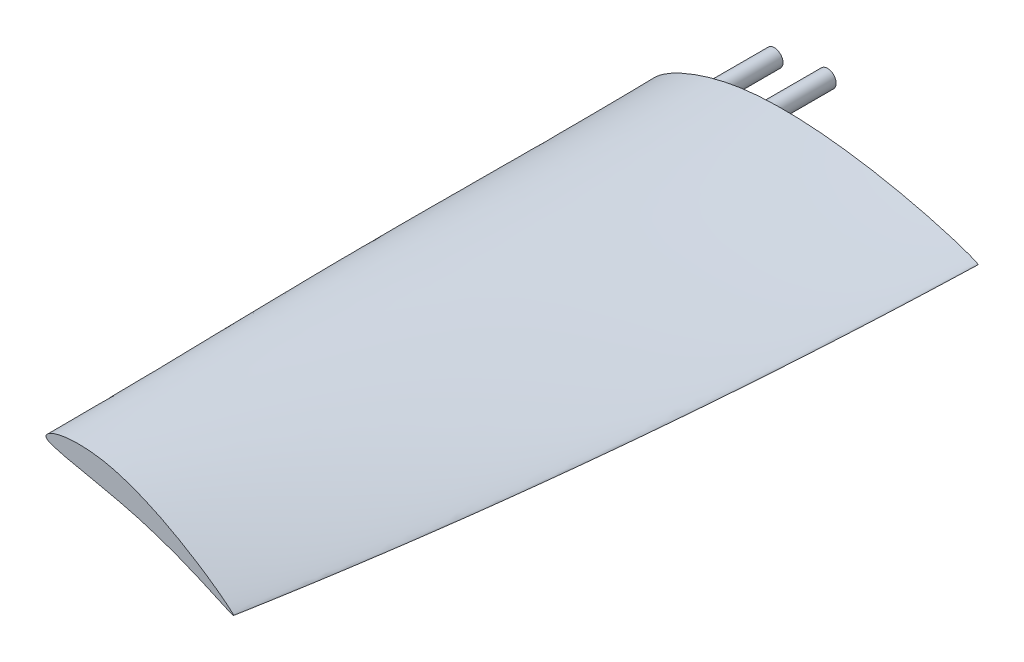
ISO-10303-21;
HEADER;
FILE_DESCRIPTION(('STEP AP214'),'2;1');
FILE_NAME('part.step','',(''),(''),'','','');
FILE_SCHEMA(('AUTOMOTIVE_DESIGN { 1 0 10303 214 1 1 1 1 }'));
ENDSEC;
DATA;
#1=APPLICATION_CONTEXT('core data for automotive mechanical design processes');
#2=APPLICATION_PROTOCOL_DEFINITION('international standard','automotive_design',2000,#1);
#3=PRODUCT_CONTEXT('',#1,'mechanical');
#4=PRODUCT('Part','Part','',(#3));
#5=PRODUCT_RELATED_PRODUCT_CATEGORY('part','',(#4));
#6=PRODUCT_DEFINITION_FORMATION('','',#4);
#7=PRODUCT_DEFINITION_CONTEXT('part definition',#1,'design');
#8=PRODUCT_DEFINITION('design','',#6,#7);
#9=PRODUCT_DEFINITION_SHAPE('','',#8);
#10=(LENGTH_UNIT() NAMED_UNIT(*) SI_UNIT(.MILLI.,.METRE.));
#11=(NAMED_UNIT(*) PLANE_ANGLE_UNIT() SI_UNIT($,.RADIAN.));
#12=(NAMED_UNIT(*) SI_UNIT($,.STERADIAN.) SOLID_ANGLE_UNIT());
#13=UNCERTAINTY_MEASURE_WITH_UNIT(LENGTH_MEASURE(1.E-05),#10,'distance_accuracy_value','');
#14=(GEOMETRIC_REPRESENTATION_CONTEXT(3) GLOBAL_UNCERTAINTY_ASSIGNED_CONTEXT((#13)) GLOBAL_UNIT_ASSIGNED_CONTEXT((#10,
#11,#12)) REPRESENTATION_CONTEXT('',''));
#15=CARTESIAN_POINT('',(0.,0.,0.));
#16=DIRECTION('',(0.,0.,1.));
#17=DIRECTION('',(1.,0.,0.));
#18=AXIS2_PLACEMENT_3D('',#15,#16,#17);
#19=CARTESIAN_POINT('',(0.,0.,0.));
#20=DIRECTION('',(0.,0.,1.));
#21=DIRECTION('',(1.,0.,0.));
#22=AXIS2_PLACEMENT_3D('',#19,#20,#21);
#23=PLANE('',#22);
#24=CARTESIAN_POINT('',(16.1545922957954,11.0402135577881,0.));
#25=DIRECTION('',(0.,0.,1.));
#26=DIRECTION('',(1.,0.,0.));
#27=AXIS2_PLACEMENT_3D('',#24,#25,#26);
#28=CIRCLE('',#27,2.5);
#29=CARTESIAN_POINT('',(18.6545922957954,11.0402135577881,0.));
#30=VERTEX_POINT('',#29);
#31=EDGE_CURVE('E63',#30,#30,#28,.F.);
#32=ORIENTED_EDGE('',*,*,#31,.F.);
#33=EDGE_LOOP('',(#32));
#34=FACE_BOUND('',#33,.T.);
#35=CARTESIAN_POINT('',(95.1052697015641,8.64289539133773,0.));
#36=CARTESIAN_POINT('',(95.1286443048925,8.54086350345673,0.));
#37=CARTESIAN_POINT('',(93.6373999787202,7.84881716845671,0.));
#38=CARTESIAN_POINT('',(52.3024701452342,13.7719575403638,0.));
#39=CARTESIAN_POINT('',(0.105539997127001,2.14606283403367,0.));
#40=CARTESIAN_POINT('',(-0.705893262256306,9.56382047975348,0.));
#41=CARTESIAN_POINT('',(32.647459862948,27.1253679543828,0.));
#42=CARTESIAN_POINT('',(87.100101196796,12.350906160891,0.));
#43=CARTESIAN_POINT('',(94.7973276750413,8.96260164870809,0.));
#44=CARTESIAN_POINT('',(95.0687945892292,8.71744855810595,0.));
#45=CARTESIAN_POINT('',(95.0983288438702,8.67319275313999,0.));
#46=CARTESIAN_POINT('',(95.1052697015641,8.64289539133773,0.));
#47=B_SPLINE_CURVE_WITH_KNOTS('',3,(#35,#36,#37,#38,#39,#40,#41,#42,#43,#44,#45,#46),
.UNSPECIFIED.,.T.,.F.,(4,1,1,1,1,1,1,1,1,4),(0.,0.0203697728095786,0.203697728058923,
0.356157624886157,0.395463832500693,0.596759804204282,0.959675980424115,0.991935196084823,
0.993951397063617,1.),.UNSPECIFIED.);
#48=CARTESIAN_POINT('',(95.1052697015641,8.64289539133773,0.));
#49=VERTEX_POINT('',#48);
#50=EDGE_CURVE('E71',#49,#49,#47,.T.);
#51=ORIENTED_EDGE('',*,*,#50,.T.);
#52=EDGE_LOOP('',(#51));
#53=FACE_BOUND('',#52,.T.);
#54=CARTESIAN_POINT('',(31.5512097241706,13.553947015482,0.));
#55=DIRECTION('',(0.,0.,1.));
#56=DIRECTION('',(1.,0.,0.));
#57=AXIS2_PLACEMENT_3D('',#54,#55,#56);
#58=CIRCLE('',#57,2.5);
#59=CARTESIAN_POINT('',(34.0512097241706,13.553947015482,0.));
#60=VERTEX_POINT('',#59);
#61=EDGE_CURVE('E12',#60,#60,#58,.F.);
#62=ORIENTED_EDGE('',*,*,#61,.F.);
#63=EDGE_LOOP('',(#62));
#64=FACE_BOUND('',#63,.T.);
#65=ADVANCED_FACE('F53',(#34,#53,#64),#23,.F.);
#66=CARTESIAN_POINT('',(36.0321446774879,8.08462591773713,180.));
#67=DIRECTION('',(0.,0.,-1.));
#68=DIRECTION('',(-1.,0.,0.));
#69=AXIS2_PLACEMENT_3D('',#66,#67,#68);
#70=PLANE('',#69);
#71=CARTESIAN_POINT('',(32.3516391595153,3.42891641202715,180.));
#72=CARTESIAN_POINT('',(46.0038360249802,-0.443143833158928,180.));
#73=CARTESIAN_POINT('',(61.1386685959756,-8.5429891593088,180.));
#74=CARTESIAN_POINT('',(57.1947597138644,-4.25442921391039,180.));
#75=CARTESIAN_POINT('',(28.2063763244082,16.1797835731895,180.));
#76=CARTESIAN_POINT('',(5.79739464769958,13.1228208000596,180.));
#77=CARTESIAN_POINT('',(4.73267983547473,8.77405761477878,180.));
#78=CARTESIAN_POINT('',(20.9981468743755,6.64901399445526,180.));
#79=CARTESIAN_POINT('',(32.3516391595153,3.42891641202715,180.));
#80=B_SPLINE_CURVE_WITH_KNOTS('',3,(#71,#72,#73,#74,#75,#76,#77,#78,#79),.UNSPECIFIED.,.T.,.F.,
(4,1,1,1,1,1,4),(0.,0.183327955249344,0.244021747634808,0.606937923854641,0.80823389555823,
0.847540103172766,1.),.UNSPECIFIED.);
#81=CARTESIAN_POINT('',(32.3516391595153,3.42891641202715,180.));
#82=VERTEX_POINT('',#81);
#83=EDGE_CURVE('E67',#82,#82,#80,.T.);
#84=ORIENTED_EDGE('',*,*,#83,.T.);
#85=EDGE_LOOP('',(#84));
#86=FACE_BOUND('',#85,.T.);
#87=ADVANCED_FACE('F85',(#86),#70,.F.);
#88=CARTESIAN_POINT('',(59.6282353848712,-7.05801971931992,180.));
#89=CARTESIAN_POINT('',(65.8250508196849,-6.3879164879489,149.944537816352));
#90=CARTESIAN_POINT('',(77.9467739051095,-3.10335834766765,89.8329940362058));
#91=CARTESIAN_POINT('',(89.4775036858622,4.07214017175802,29.9441246188426));
#92=CARTESIAN_POINT('',(95.1052697015641,8.64289539133773,0.));
#93=CARTESIAN_POINT('',(59.620476173678,-7.12034363770423,180.));
#94=CARTESIAN_POINT('',(65.8207044635046,-6.45759096964255,149.944537816352));
#95=CARTESIAN_POINT('',(77.94926594838,-3.18776128630056,89.8329940362058));
#96=CARTESIAN_POINT('',(89.4939088300595,3.97599186524667,29.9441246188426));
#97=CARTESIAN_POINT('',(95.1286443048925,8.54086350345673,0.));
#98=CARTESIAN_POINT('',(58.6376731282113,-7.20450877934647,180.));
#99=CARTESIAN_POINT('',(64.7361110750332,-6.61817361510636,149.944537816352));
#100=CARTESIAN_POINT('',(76.6607134045781,-3.50146306931555,89.8329940362058));
#101=CARTESIAN_POINT('',(88.0703119613591,3.41021629806378,29.9441246188426));
#102=CARTESIAN_POINT('',(93.6373999787202,7.84881716845671,0.));
#103=CARTESIAN_POINT('',(36.5478959924359,4.61747717587286,180.));
#104=CARTESIAN_POINT('',(39.4206723134616,4.98688855597323,149.944537816352));
#105=CARTESIAN_POINT('',(44.8819579750453,7.66894498352202,89.8329940362058));
#106=CARTESIAN_POINT('',(49.9247117298213,11.0846083148984,29.9441246188426));
#107=CARTESIAN_POINT('',(52.3024701452342,13.7719575403638,0.));
#108=CARTESIAN_POINT('',(4.73267983547473,8.77405761477878,180.));
#109=CARTESIAN_POINT('',(3.83974960466323,7.42267820557724,149.944537816352));
#110=CARTESIAN_POINT('',(1.7556207911214,6.65675493754226,89.8329940362058));
#111=CARTESIAN_POINT('',(0.755050593874905,3.00098910801779,29.9441246188426));
#112=CARTESIAN_POINT('',(0.105539997127001,2.14606283403367,0.));
#113=CARTESIAN_POINT('',(5.79739464769958,13.1228208000596,180.));
#114=CARTESIAN_POINT('',(4.723590049957,12.3201253450925,149.944537816352));
#115=CARTESIAN_POINT('',(2.27703998886601,12.6536100616042,89.8329940362058));
#116=CARTESIAN_POINT('',(0.388450760175923,9.94452702079389,29.9441246188426));
#117=CARTESIAN_POINT('',(-0.705893262256306,9.56382047975348,0.));
#118=CARTESIAN_POINT('',(28.2063763244082,16.1797835731895,180.));
#119=CARTESIAN_POINT('',(29.3756886292575,17.2440089512248,149.944537816352));
#120=CARTESIAN_POINT('',(31.4237125646344,21.3182767806366,89.8329940362058));
#121=CARTESIAN_POINT('',(32.3378434473303,24.5367811402193,29.9441246188426));
#122=CARTESIAN_POINT('',(32.647459862948,27.1253679543828,0.));
#123=CARTESIAN_POINT('',(55.8757253465376,-3.32462817694541,180.));
#124=CARTESIAN_POINT('',(61.4066099762098,-2.50259835488888,149.944537816352));
#125=CARTESIAN_POINT('',(72.1939954367084,1.08637784897081,89.8329940362058));
#126=CARTESIAN_POINT('',(82.2240600779467,7.94092460446027,29.9441246188426));
#127=CARTESIAN_POINT('',(87.100101196796,12.350906160891,0.));
#128=CARTESIAN_POINT('',(59.5202204628799,-6.81457092716951,180.));
#129=CARTESIAN_POINT('',(65.6885681966596,-6.12521409913936,149.944537816352));
#130=CARTESIAN_POINT('',(77.7532500335166,-2.80207717824146,89.8329940362058));
#131=CARTESIAN_POINT('',(89.2077481964506,4.38569714010175,29.9441246188426));
#132=CARTESIAN_POINT('',(94.7973276750413,8.96260164870809,0.));
#133=CARTESIAN_POINT('',(59.6229693593991,-7.00850034902975,180.));
#134=CARTESIAN_POINT('',(65.8158222376352,-6.33333843746423,149.944537816352));
#135=CARTESIAN_POINT('',(77.9296054766198,-3.03864412798359,89.8329940362058));
#136=CARTESIAN_POINT('',(89.447472091163,4.14340963483258,29.9441246188426));
#137=CARTESIAN_POINT('',(95.0687945892292,8.71744855810595,0.));
#138=CARTESIAN_POINT('',(59.6305394060326,-7.03951324704503,180.));
#139=CARTESIAN_POINT('',(65.8263414272435,-6.36722733846733,149.944537816352));
#140=CARTESIAN_POINT('',(77.9460339174629,-3.07829572830382,89.8329940362058));
#141=CARTESIAN_POINT('',(89.4726323402516,4.10069046215789,29.9441246188426));
#142=CARTESIAN_POINT('',(95.0983288438702,8.67319275313999,0.));
#143=CARTESIAN_POINT('',(59.6282353848712,-7.05801971931992,180.));
#144=CARTESIAN_POINT('',(65.8250508196849,-6.3879164879489,149.944537816352));
#145=CARTESIAN_POINT('',(77.9467739051095,-3.10335834766765,89.8329940362058));
#146=CARTESIAN_POINT('',(89.4775036858622,4.07214017175802,29.9441246188426));
#147=CARTESIAN_POINT('',(95.1052697015641,8.64289539133773,0.));
#148=B_SPLINE_SURFACE_WITH_KNOTS('',3,3,((#88,#89,#90,#91,#92),(#93,#94,#95,#96,#97),(#98,#99,
#100,#101,#102),(#103,#104,#105,#106,#107),(#108,#109,#110,#111,#112),(#113,#114,#115,#116,
#117),(#118,#119,#120,#121,#122),(#123,#124,#125,#126,#127),(#128,#129,#130,#131,#132),(#133,
#134,#135,#136,#137),(#138,#139,#140,#141,#142),(#143,#144,#145,#146,#147)),.UNSPECIFIED.,.T.,
.F.,.F.,(4,1,1,1,1,1,1,1,1,4),(4,1,4),(0.,0.0203697728095786,0.203697728058923,
0.356157624886157,0.395463832500693,0.596759804204282,0.959675980424115,0.991935196084823,
0.993951397063617,1.),(0.,0.499072193350194,1.),.UNSPECIFIED.);
#149=ORIENTED_EDGE('',*,*,#83,.F.);
#150=EDGE_LOOP('',(#149));
#151=FACE_BOUND('',#150,.T.);
#152=ORIENTED_EDGE('',*,*,#50,.F.);
#153=EDGE_LOOP('',(#152));
#154=FACE_BOUND('',#153,.T.);
#155=ADVANCED_FACE('F55',(#151,#154),#148,.T.);
#156=CARTESIAN_POINT('',(16.1545922957954,11.0402135577881,-20.));
#157=DIRECTION('',(0.,0.,1.));
#158=DIRECTION('',(1.,0.,0.));
#159=AXIS2_PLACEMENT_3D('',#156,#157,#158);
#160=CYLINDRICAL_SURFACE('',#159,2.5);
#161=CARTESIAN_POINT('',(16.1545922957954,11.0402135577881,-20.));
#162=DIRECTION('',(0.,0.,-1.));
#163=DIRECTION('',(-1.,0.,0.));
#164=AXIS2_PLACEMENT_3D('',#161,#162,#163);
#165=CIRCLE('',#164,2.5);
#166=CARTESIAN_POINT('',(13.6545922957954,11.0402135577881,-20.));
#167=VERTEX_POINT('',#166);
#168=EDGE_CURVE('E118',#167,#167,#165,.T.);
#169=ORIENTED_EDGE('',*,*,#168,.F.);
#170=EDGE_LOOP('',(#169));
#171=FACE_BOUND('',#170,.T.);
#172=ORIENTED_EDGE('',*,*,#31,.T.);
#173=EDGE_LOOP('',(#172));
#174=FACE_BOUND('',#173,.T.);
#175=ADVANCED_FACE('F98',(#171,#174),#160,.T.);
#176=CARTESIAN_POINT('',(16.1545922957954,11.0402135577881,-20.));
#177=DIRECTION('',(0.,0.,-1.));
#178=DIRECTION('',(-1.,0.,0.));
#179=AXIS2_PLACEMENT_3D('',#176,#177,#178);
#180=PLANE('',#179);
#181=ORIENTED_EDGE('',*,*,#168,.T.);
#182=EDGE_LOOP('',(#181));
#183=FACE_BOUND('',#182,.T.);
#184=ADVANCED_FACE('F101',(#183),#180,.T.);
#185=CARTESIAN_POINT('',(31.5512097241706,13.553947015482,-20.));
#186=DIRECTION('',(0.,0.,1.));
#187=DIRECTION('',(1.,0.,0.));
#188=AXIS2_PLACEMENT_3D('',#185,#186,#187);
#189=CYLINDRICAL_SURFACE('',#188,2.5);
#190=CARTESIAN_POINT('',(31.5512097241706,13.553947015482,-20.));
#191=DIRECTION('',(0.,0.,-1.));
#192=DIRECTION('',(-1.,0.,0.));
#193=AXIS2_PLACEMENT_3D('',#190,#191,#192);
#194=CIRCLE('',#193,2.5);
#195=CARTESIAN_POINT('',(29.0512097241706,13.553947015482,-20.));
#196=VERTEX_POINT('',#195);
#197=EDGE_CURVE('E117',#196,#196,#194,.T.);
#198=ORIENTED_EDGE('',*,*,#197,.F.);
#199=EDGE_LOOP('',(#198));
#200=FACE_BOUND('',#199,.T.);
#201=ORIENTED_EDGE('',*,*,#61,.T.);
#202=EDGE_LOOP('',(#201));
#203=FACE_BOUND('',#202,.T.);
#204=ADVANCED_FACE('F105',(#200,#203),#189,.T.);
#205=CARTESIAN_POINT('',(31.5512097241706,13.553947015482,-20.));
#206=DIRECTION('',(0.,0.,-1.));
#207=DIRECTION('',(-1.,0.,0.));
#208=AXIS2_PLACEMENT_3D('',#205,#206,#207);
#209=PLANE('',#208);
#210=ORIENTED_EDGE('',*,*,#197,.T.);
#211=EDGE_LOOP('',(#210));
#212=FACE_BOUND('',#211,.T.);
#213=ADVANCED_FACE('F109',(#212),#209,.T.);
#214=CLOSED_SHELL('',(#65,#87,#155,#175,#184,#204,#213));
#215=MANIFOLD_SOLID_BREP('B2',#214);
#216=ADVANCED_BREP_SHAPE_REPRESENTATION('',(#18,#215),#14);
#217=SHAPE_DEFINITION_REPRESENTATION(#9,#216);
ENDSEC;
END-ISO-10303-21;
